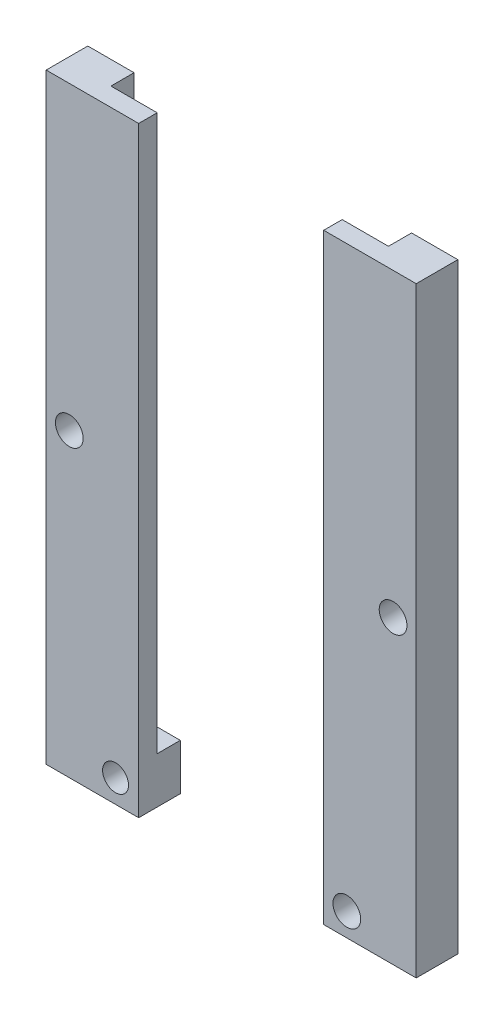
ISO-10303-21;
HEADER;
FILE_DESCRIPTION(('STEP AP214'),'2;1');
FILE_NAME('part.step','',(''),(''),'','','');
FILE_SCHEMA(('AUTOMOTIVE_DESIGN { 1 0 10303 214 1 1 1 1 }'));
ENDSEC;
DATA;
#1=APPLICATION_CONTEXT('core data for automotive mechanical design processes');
#2=APPLICATION_PROTOCOL_DEFINITION('international standard','automotive_design',2000,#1);
#3=PRODUCT_CONTEXT('',#1,'mechanical');
#4=PRODUCT('Part','Part','',(#3));
#5=PRODUCT_RELATED_PRODUCT_CATEGORY('part','',(#4));
#6=PRODUCT_DEFINITION_FORMATION('','',#4);
#7=PRODUCT_DEFINITION_CONTEXT('part definition',#1,'design');
#8=PRODUCT_DEFINITION('design','',#6,#7);
#9=PRODUCT_DEFINITION_SHAPE('','',#8);
#10=(LENGTH_UNIT() NAMED_UNIT(*) SI_UNIT(.MILLI.,.METRE.));
#11=(NAMED_UNIT(*) PLANE_ANGLE_UNIT() SI_UNIT($,.RADIAN.));
#12=(NAMED_UNIT(*) SI_UNIT($,.STERADIAN.) SOLID_ANGLE_UNIT());
#13=UNCERTAINTY_MEASURE_WITH_UNIT(LENGTH_MEASURE(1.E-05),#10,'distance_accuracy_value','');
#14=(GEOMETRIC_REPRESENTATION_CONTEXT(3) GLOBAL_UNCERTAINTY_ASSIGNED_CONTEXT((#13)) GLOBAL_UNIT_ASSIGNED_CONTEXT((#10,
#11,#12)) REPRESENTATION_CONTEXT('',''));
#15=CARTESIAN_POINT('',(0.,0.,0.));
#16=DIRECTION('',(0.,0.,1.));
#17=DIRECTION('',(1.,0.,0.));
#18=AXIS2_PLACEMENT_3D('',#15,#16,#17);
#19=CARTESIAN_POINT('',(-6.42824188498933,-97.8825712637996,4.5));
#20=DIRECTION('',(1.,0.,0.));
#21=DIRECTION('',(0.,0.,-1.));
#22=AXIS2_PLACEMENT_3D('',#19,#20,#21);
#23=PLANE('',#22);
#24=DIRECTION('',(0.,-1.,0.));
#25=VECTOR('',#24,1.);
#26=CARTESIAN_POINT('',(-6.42824188498933,-67.8825712637996,2.5));
#27=LINE('',#26,#25);
#28=CARTESIAN_POINT('',(-6.42824188498933,-37.8825712637996,2.5));
#29=VERTEX_POINT('',#28);
#30=CARTESIAN_POINT('',(-6.42824188498933,-97.8825712637996,2.5));
#31=VERTEX_POINT('',#30);
#32=EDGE_CURVE('E130',#29,#31,#27,.T.);
#33=ORIENTED_EDGE('',*,*,#32,.F.);
#34=DIRECTION('',(0.,0.,1.));
#35=VECTOR('',#34,1.);
#36=CARTESIAN_POINT('',(-6.42824188498933,-37.8825712637996,0.));
#37=LINE('',#36,#35);
#38=CARTESIAN_POINT('',(-6.42824188498933,-37.8825712637996,0.));
#39=VERTEX_POINT('',#38);
#40=EDGE_CURVE('E120',#39,#29,#37,.T.);
#41=ORIENTED_EDGE('',*,*,#40,.F.);
#42=DIRECTION('',(0.,-1.,0.));
#43=VECTOR('',#42,1.);
#44=CARTESIAN_POINT('',(-6.42824188498933,-97.8825712637996,0.));
#45=LINE('',#44,#43);
#46=CARTESIAN_POINT('',(-6.42824188498933,-97.8825712637996,0.));
#47=VERTEX_POINT('',#46);
#48=EDGE_CURVE('E117',#39,#47,#45,.T.);
#49=ORIENTED_EDGE('',*,*,#48,.T.);
#50=DIRECTION('',(0.,0.,-1.));
#51=VECTOR('',#50,1.);
#52=CARTESIAN_POINT('',(-6.42824188498933,-97.8825712637996,4.5));
#53=LINE('',#52,#51);
#54=EDGE_CURVE('E52',#31,#47,#53,.T.);
#55=ORIENTED_EDGE('',*,*,#54,.F.);
#56=EDGE_LOOP('',(#33,#41,#49,#55));
#57=FACE_BOUND('',#56,.T.);
#58=ADVANCED_FACE('F43',(#57),#23,.F.);
#59=CARTESIAN_POINT('',(-11.4282418849893,-97.8825712637996,4.5));
#60=DIRECTION('',(0.,-1.,0.));
#61=DIRECTION('',(0.,0.,-1.));
#62=AXIS2_PLACEMENT_3D('',#59,#60,#61);
#63=PLANE('',#62);
#64=DIRECTION('',(1.,0.,0.));
#65=VECTOR('',#64,1.);
#66=CARTESIAN_POINT('',(-11.4282418849893,-97.8825712637996,2.5));
#67=LINE('',#66,#65);
#68=CARTESIAN_POINT('',(-11.4282418849893,-97.8825712637996,2.5));
#69=VERTEX_POINT('',#68);
#70=EDGE_CURVE('E93',#69,#31,#67,.T.);
#71=ORIENTED_EDGE('',*,*,#70,.T.);
#72=ORIENTED_EDGE('',*,*,#54,.T.);
#73=DIRECTION('',(-1.,0.,0.));
#74=VECTOR('',#73,1.);
#75=CARTESIAN_POINT('',(-11.4282418849893,-97.8825712637996,0.));
#76=LINE('',#75,#74);
#77=CARTESIAN_POINT('',(-11.4282418849893,-97.8825712637996,0.));
#78=VERTEX_POINT('',#77);
#79=EDGE_CURVE('E99',#47,#78,#76,.T.);
#80=ORIENTED_EDGE('',*,*,#79,.T.);
#81=DIRECTION('',(0.,0.,-1.));
#82=VECTOR('',#81,1.);
#83=CARTESIAN_POINT('',(-11.4282418849893,-97.8825712637996,4.5));
#84=LINE('',#83,#82);
#85=EDGE_CURVE('E77',#69,#78,#84,.T.);
#86=ORIENTED_EDGE('',*,*,#85,.F.);
#87=EDGE_LOOP('',(#71,#72,#80,#86));
#88=FACE_BOUND('',#87,.T.);
#89=ADVANCED_FACE('F110',(#88),#63,.F.);
#90=CARTESIAN_POINT('',(-1.42824188498932,-102.8825712638,4.5));
#91=DIRECTION('',(0.,1.,0.));
#92=DIRECTION('',(0.,0.,1.));
#93=AXIS2_PLACEMENT_3D('',#90,#91,#92);
#94=PLANE('',#93);
#95=DIRECTION('',(1.,0.,0.));
#96=VECTOR('',#95,1.);
#97=CARTESIAN_POINT('',(-1.42824188498932,-102.8825712638,0.));
#98=LINE('',#97,#96);
#99=CARTESIAN_POINT('',(-11.4282418849893,-102.8825712638,0.));
#100=VERTEX_POINT('',#99);
#101=CARTESIAN_POINT('',(-1.42824188498932,-102.8825712638,0.));
#102=VERTEX_POINT('',#101);
#103=EDGE_CURVE('E83',#100,#102,#98,.T.);
#104=ORIENTED_EDGE('',*,*,#103,.T.);
#105=DIRECTION('',(0.,0.,-1.));
#106=VECTOR('',#105,1.);
#107=CARTESIAN_POINT('',(-1.42824188498932,-102.8825712638,4.5));
#108=LINE('',#107,#106);
#109=CARTESIAN_POINT('',(-1.42824188498932,-102.8825712638,4.5));
#110=VERTEX_POINT('',#109);
#111=EDGE_CURVE('E12',#110,#102,#108,.T.);
#112=ORIENTED_EDGE('',*,*,#111,.F.);
#113=DIRECTION('',(1.,0.,0.));
#114=VECTOR('',#113,1.);
#115=CARTESIAN_POINT('',(-6.42824188498933,-102.8825712638,4.5));
#116=LINE('',#115,#114);
#117=CARTESIAN_POINT('',(-11.4282418849893,-102.8825712638,4.5));
#118=VERTEX_POINT('',#117);
#119=EDGE_CURVE('E98',#118,#110,#116,.T.);
#120=ORIENTED_EDGE('',*,*,#119,.F.);
#121=DIRECTION('',(0.,0.,-1.));
#122=VECTOR('',#121,1.);
#123=CARTESIAN_POINT('',(-11.4282418849893,-102.8825712638,4.5));
#124=LINE('',#123,#122);
#125=EDGE_CURVE('E96',#118,#100,#124,.T.);
#126=ORIENTED_EDGE('',*,*,#125,.T.);
#127=EDGE_LOOP('',(#104,#112,#120,#126));
#128=FACE_BOUND('',#127,.T.);
#129=ADVANCED_FACE('F45',(#128),#94,.F.);
#130=CARTESIAN_POINT('',(-1.42824188498933,-67.8825712637996,4.5));
#131=DIRECTION('',(-1.,0.,0.));
#132=DIRECTION('',(0.,0.,1.));
#133=AXIS2_PLACEMENT_3D('',#130,#131,#132);
#134=PLANE('',#133);
#135=DIRECTION('',(0.,1.,0.));
#136=VECTOR('',#135,1.);
#137=CARTESIAN_POINT('',(-1.42824188498933,-67.8825712637996,0.));
#138=LINE('',#137,#136);
#139=CARTESIAN_POINT('',(-1.42824188498933,-37.8825712637996,0.));
#140=VERTEX_POINT('',#139);
#141=EDGE_CURVE('E89',#102,#140,#138,.T.);
#142=ORIENTED_EDGE('',*,*,#141,.T.);
#143=DIRECTION('',(0.,0.,-1.));
#144=VECTOR('',#143,1.);
#145=CARTESIAN_POINT('',(-1.42824188498933,-37.8825712637996,4.5));
#146=LINE('',#145,#144);
#147=CARTESIAN_POINT('',(-1.42824188498933,-37.8825712637996,4.5));
#148=VERTEX_POINT('',#147);
#149=EDGE_CURVE('E158',#148,#140,#146,.T.);
#150=ORIENTED_EDGE('',*,*,#149,.F.);
#151=DIRECTION('',(0.,1.,0.));
#152=VECTOR('',#151,1.);
#153=CARTESIAN_POINT('',(-1.42824188498933,-72.8825712637996,4.5));
#154=LINE('',#153,#152);
#155=EDGE_CURVE('E103',#110,#148,#154,.T.);
#156=ORIENTED_EDGE('',*,*,#155,.F.);
#157=ORIENTED_EDGE('',*,*,#111,.T.);
#158=EDGE_LOOP('',(#142,#150,#156,#157));
#159=FACE_BOUND('',#158,.T.);
#160=ADVANCED_FACE('F168',(#159),#134,.F.);
#161=CARTESIAN_POINT('',(-11.4282418849893,-102.8825712638,4.5));
#162=DIRECTION('',(1.,0.,0.));
#163=DIRECTION('',(0.,0.,-1.));
#164=AXIS2_PLACEMENT_3D('',#161,#162,#163);
#165=PLANE('',#164);
#166=DIRECTION('',(0.,-1.,0.));
#167=VECTOR('',#166,1.);
#168=CARTESIAN_POINT('',(-11.4282418849893,-102.8825712638,0.));
#169=LINE('',#168,#167);
#170=EDGE_CURVE('E86',#78,#100,#169,.T.);
#171=ORIENTED_EDGE('',*,*,#170,.T.);
#172=ORIENTED_EDGE('',*,*,#125,.F.);
#173=DIRECTION('',(0.,-1.,0.));
#174=VECTOR('',#173,1.);
#175=CARTESIAN_POINT('',(-11.4282418849893,-102.8825712638,4.5));
#176=LINE('',#175,#174);
#177=CARTESIAN_POINT('',(-11.4282418849893,-37.8825712637996,4.5));
#178=VERTEX_POINT('',#177);
#179=EDGE_CURVE('E60',#178,#118,#176,.T.);
#180=ORIENTED_EDGE('',*,*,#179,.F.);
#181=DIRECTION('',(0.,0.,1.));
#182=VECTOR('',#181,1.);
#183=CARTESIAN_POINT('',(-11.4282418849893,-37.8825712637996,2.5));
#184=LINE('',#183,#182);
#185=CARTESIAN_POINT('',(-11.4282418849893,-37.8825712637996,2.5));
#186=VERTEX_POINT('',#185);
#187=EDGE_CURVE('E149',#186,#178,#184,.T.);
#188=ORIENTED_EDGE('',*,*,#187,.F.);
#189=DIRECTION('',(0.,-1.,0.));
#190=VECTOR('',#189,1.);
#191=CARTESIAN_POINT('',(-11.4282418849893,-67.8825712637996,2.5));
#192=LINE('',#191,#190);
#193=EDGE_CURVE('E129',#186,#69,#192,.T.);
#194=ORIENTED_EDGE('',*,*,#193,.T.);
#195=ORIENTED_EDGE('',*,*,#85,.T.);
#196=EDGE_LOOP('',(#171,#172,#180,#188,#194,#195));
#197=FACE_BOUND('',#196,.T.);
#198=ADVANCED_FACE('F95',(#197),#165,.F.);
#199=CARTESIAN_POINT('',(0.,0.,4.5));
#200=DIRECTION('',(0.,0.,-1.));
#201=DIRECTION('',(-1.,0.,0.));
#202=AXIS2_PLACEMENT_3D('',#199,#200,#201);
#203=PLANE('',#202);
#204=CARTESIAN_POINT('',(-8.92824188498932,-100.3825712638,4.5));
#205=DIRECTION('',(0.,0.,-1.));
#206=DIRECTION('',(-1.,0.,0.));
#207=AXIS2_PLACEMENT_3D('',#204,#205,#206);
#208=CIRCLE('',#207,1.5);
#209=CARTESIAN_POINT('',(-10.4282418849893,-100.3825712638,4.5));
#210=VERTEX_POINT('',#209);
#211=EDGE_CURVE('E133',#210,#210,#208,.T.);
#212=ORIENTED_EDGE('',*,*,#211,.T.);
#213=EDGE_LOOP('',(#212));
#214=FACE_BOUND('',#213,.T.);
#215=CARTESIAN_POINT('',(-3.92824188498932,-70.3825712637996,4.5));
#216=DIRECTION('',(0.,0.,-1.));
#217=DIRECTION('',(-1.,0.,0.));
#218=AXIS2_PLACEMENT_3D('',#215,#216,#217);
#219=CIRCLE('',#218,1.5);
#220=CARTESIAN_POINT('',(-5.42824188498932,-70.3825712637996,4.5));
#221=VERTEX_POINT('',#220);
#222=EDGE_CURVE('E138',#221,#221,#219,.T.);
#223=ORIENTED_EDGE('',*,*,#222,.T.);
#224=EDGE_LOOP('',(#223));
#225=FACE_BOUND('',#224,.T.);
#226=ORIENTED_EDGE('',*,*,#155,.T.);
#227=DIRECTION('',(1.,0.,0.));
#228=VECTOR('',#227,1.);
#229=CARTESIAN_POINT('',(-11.4282418849893,-37.8825712637996,4.5));
#230=LINE('',#229,#228);
#231=EDGE_CURVE('E139',#178,#148,#230,.T.);
#232=ORIENTED_EDGE('',*,*,#231,.F.);
#233=ORIENTED_EDGE('',*,*,#179,.T.);
#234=ORIENTED_EDGE('',*,*,#119,.T.);
#235=EDGE_LOOP('',(#226,#232,#233,#234));
#236=FACE_BOUND('',#235,.T.);
#237=ADVANCED_FACE('F183',(#214,#225,#236),#203,.F.);
#238=CARTESIAN_POINT('',(0.,0.,0.));
#239=DIRECTION('',(0.,0.,-1.));
#240=DIRECTION('',(-1.,0.,0.));
#241=AXIS2_PLACEMENT_3D('',#238,#239,#240);
#242=PLANE('',#241);
#243=CARTESIAN_POINT('',(-8.92824188498932,-100.3825712638,0.));
#244=DIRECTION('',(0.,0.,-1.));
#245=DIRECTION('',(-1.,0.,0.));
#246=AXIS2_PLACEMENT_3D('',#243,#244,#245);
#247=CIRCLE('',#246,1.5);
#248=CARTESIAN_POINT('',(-10.4282418849893,-100.3825712638,0.));
#249=VERTEX_POINT('',#248);
#250=EDGE_CURVE('E142',#249,#249,#247,.T.);
#251=ORIENTED_EDGE('',*,*,#250,.F.);
#252=EDGE_LOOP('',(#251));
#253=FACE_BOUND('',#252,.T.);
#254=CARTESIAN_POINT('',(-3.92824188498932,-70.3825712637996,0.));
#255=DIRECTION('',(0.,0.,-1.));
#256=DIRECTION('',(-1.,0.,0.));
#257=AXIS2_PLACEMENT_3D('',#254,#255,#256);
#258=CIRCLE('',#257,1.5);
#259=CARTESIAN_POINT('',(-5.42824188498932,-70.3825712637996,0.));
#260=VERTEX_POINT('',#259);
#261=EDGE_CURVE('E135',#260,#260,#258,.T.);
#262=ORIENTED_EDGE('',*,*,#261,.F.);
#263=EDGE_LOOP('',(#262));
#264=FACE_BOUND('',#263,.T.);
#265=ORIENTED_EDGE('',*,*,#103,.F.);
#266=ORIENTED_EDGE('',*,*,#170,.F.);
#267=ORIENTED_EDGE('',*,*,#79,.F.);
#268=ORIENTED_EDGE('',*,*,#48,.F.);
#269=DIRECTION('',(-1.,0.,0.));
#270=VECTOR('',#269,1.);
#271=CARTESIAN_POINT('',(-1.42824188498933,-37.8825712637996,0.));
#272=LINE('',#271,#270);
#273=EDGE_CURVE('E156',#140,#39,#272,.T.);
#274=ORIENTED_EDGE('',*,*,#273,.F.);
#275=ORIENTED_EDGE('',*,*,#141,.F.);
#276=EDGE_LOOP('',(#265,#266,#267,#268,#274,#275));
#277=FACE_BOUND('',#276,.T.);
#278=ADVANCED_FACE('F84',(#253,#264,#277),#242,.T.);
#279=CARTESIAN_POINT('',(-11.4282418849893,-67.8825712637996,2.5));
#280=DIRECTION('',(0.,0.,1.));
#281=DIRECTION('',(0.,-1.,0.));
#282=AXIS2_PLACEMENT_3D('',#279,#280,#281);
#283=PLANE('',#282);
#284=ORIENTED_EDGE('',*,*,#32,.T.);
#285=ORIENTED_EDGE('',*,*,#70,.F.);
#286=ORIENTED_EDGE('',*,*,#193,.F.);
#287=DIRECTION('',(-1.,0.,0.));
#288=VECTOR('',#287,1.);
#289=CARTESIAN_POINT('',(-6.42824188498933,-37.8825712637996,2.5));
#290=LINE('',#289,#288);
#291=EDGE_CURVE('E152',#29,#186,#290,.T.);
#292=ORIENTED_EDGE('',*,*,#291,.F.);
#293=EDGE_LOOP('',(#284,#285,#286,#292));
#294=FACE_BOUND('',#293,.T.);
#295=ADVANCED_FACE('F179',(#294),#283,.F.);
#296=CARTESIAN_POINT('',(-3.92824188498932,-70.3825712637996,4.5));
#297=DIRECTION('',(0.,0.,-1.));
#298=DIRECTION('',(-1.,0.,0.));
#299=AXIS2_PLACEMENT_3D('',#296,#297,#298);
#300=CYLINDRICAL_SURFACE('',#299,1.5);
#301=ORIENTED_EDGE('',*,*,#222,.F.);
#302=EDGE_LOOP('',(#301));
#303=FACE_BOUND('',#302,.T.);
#304=ORIENTED_EDGE('',*,*,#261,.T.);
#305=EDGE_LOOP('',(#304));
#306=FACE_BOUND('',#305,.T.);
#307=ADVANCED_FACE('F214',(#303,#306),#300,.F.);
#308=CARTESIAN_POINT('',(-8.92824188498932,-100.3825712638,4.5));
#309=DIRECTION('',(0.,0.,-1.));
#310=DIRECTION('',(-1.,0.,0.));
#311=AXIS2_PLACEMENT_3D('',#308,#309,#310);
#312=CYLINDRICAL_SURFACE('',#311,1.5);
#313=ORIENTED_EDGE('',*,*,#211,.F.);
#314=EDGE_LOOP('',(#313));
#315=FACE_BOUND('',#314,.T.);
#316=ORIENTED_EDGE('',*,*,#250,.T.);
#317=EDGE_LOOP('',(#316));
#318=FACE_BOUND('',#317,.T.);
#319=ADVANCED_FACE('F217',(#315,#318),#312,.F.);
#320=CARTESIAN_POINT('',(0.,-37.8825712637996,0.));
#321=DIRECTION('',(0.,1.,0.));
#322=DIRECTION('',(0.,0.,1.));
#323=AXIS2_PLACEMENT_3D('',#320,#321,#322);
#324=PLANE('',#323);
#325=ORIENTED_EDGE('',*,*,#149,.T.);
#326=ORIENTED_EDGE('',*,*,#273,.T.);
#327=ORIENTED_EDGE('',*,*,#40,.T.);
#328=ORIENTED_EDGE('',*,*,#291,.T.);
#329=ORIENTED_EDGE('',*,*,#187,.T.);
#330=ORIENTED_EDGE('',*,*,#231,.T.);
#331=EDGE_LOOP('',(#325,#326,#327,#328,#329,#330));
#332=FACE_BOUND('',#331,.T.);
#333=ADVANCED_FACE('F163',(#332),#324,.T.);
#334=CLOSED_SHELL('',(#58,#89,#129,#160,#198,#237,#278,#295,#307,#319,#333));
#335=MANIFOLD_SOLID_BREP('B2',#334);
#336=CARTESIAN_POINT('',(-36.4282418849893,-97.8825712637996,4.5));
#337=DIRECTION('',(0.,-1.,0.));
#338=DIRECTION('',(0.,0.,-1.));
#339=AXIS2_PLACEMENT_3D('',#336,#337,#338);
#340=PLANE('',#339);
#341=DIRECTION('',(-1.,0.,0.));
#342=VECTOR('',#341,1.);
#343=CARTESIAN_POINT('',(-31.4282418849893,-97.8825712637996,2.5));
#344=LINE('',#343,#342);
#345=CARTESIAN_POINT('',(-31.4282418849893,-97.8825712637996,2.5));
#346=VERTEX_POINT('',#345);
#347=CARTESIAN_POINT('',(-36.4282418849893,-97.8825712637996,2.5));
#348=VERTEX_POINT('',#347);
#349=EDGE_CURVE('E397',#346,#348,#344,.T.);
#350=ORIENTED_EDGE('',*,*,#349,.F.);
#351=DIRECTION('',(0.,0.,-1.));
#352=VECTOR('',#351,1.);
#353=CARTESIAN_POINT('',(-31.4282418849893,-97.8825712637996,4.5));
#354=LINE('',#353,#352);
#355=CARTESIAN_POINT('',(-31.4282418849893,-97.8825712637996,0.));
#356=VERTEX_POINT('',#355);
#357=EDGE_CURVE('E329',#346,#356,#354,.T.);
#358=ORIENTED_EDGE('',*,*,#357,.T.);
#359=DIRECTION('',(-1.,0.,0.));
#360=VECTOR('',#359,1.);
#361=CARTESIAN_POINT('',(-36.4282418849893,-97.8825712637996,0.));
#362=LINE('',#361,#360);
#363=CARTESIAN_POINT('',(-36.4282418849893,-97.8825712637996,0.));
#364=VERTEX_POINT('',#363);
#365=EDGE_CURVE('E395',#356,#364,#362,.T.);
#366=ORIENTED_EDGE('',*,*,#365,.T.);
#367=DIRECTION('',(0.,0.,-1.));
#368=VECTOR('',#367,1.);
#369=CARTESIAN_POINT('',(-36.4282418849893,-97.8825712637996,4.5));
#370=LINE('',#369,#368);
#371=EDGE_CURVE('E355',#348,#364,#370,.T.);
#372=ORIENTED_EDGE('',*,*,#371,.F.);
#373=EDGE_LOOP('',(#350,#358,#366,#372));
#374=FACE_BOUND('',#373,.T.);
#375=ADVANCED_FACE('F320',(#374),#340,.F.);
#376=CARTESIAN_POINT('',(-36.4282418849893,-72.8825712637996,4.5));
#377=DIRECTION('',(-1.,0.,0.));
#378=DIRECTION('',(0.,0.,1.));
#379=AXIS2_PLACEMENT_3D('',#376,#377,#378);
#380=PLANE('',#379);
#381=DIRECTION('',(0.,1.,0.));
#382=VECTOR('',#381,1.);
#383=CARTESIAN_POINT('',(-36.4282418849893,-67.8825712637996,2.5));
#384=LINE('',#383,#382);
#385=CARTESIAN_POINT('',(-36.4282418849893,-37.8825712637996,2.5));
#386=VERTEX_POINT('',#385);
#387=EDGE_CURVE('E408',#348,#386,#384,.T.);
#388=ORIENTED_EDGE('',*,*,#387,.F.);
#389=ORIENTED_EDGE('',*,*,#371,.T.);
#390=DIRECTION('',(0.,1.,0.));
#391=VECTOR('',#390,1.);
#392=CARTESIAN_POINT('',(-36.4282418849893,-72.8825712637996,0.));
#393=LINE('',#392,#391);
#394=CARTESIAN_POINT('',(-36.4282418849893,-37.8825712637996,0.));
#395=VERTEX_POINT('',#394);
#396=EDGE_CURVE('E374',#364,#395,#393,.T.);
#397=ORIENTED_EDGE('',*,*,#396,.T.);
#398=DIRECTION('',(0.,0.,-1.));
#399=VECTOR('',#398,1.);
#400=CARTESIAN_POINT('',(-36.4282418849893,-37.8825712637996,2.5));
#401=LINE('',#400,#399);
#402=EDGE_CURVE('E436',#386,#395,#401,.T.);
#403=ORIENTED_EDGE('',*,*,#402,.F.);
#404=EDGE_LOOP('',(#388,#389,#397,#403));
#405=FACE_BOUND('',#404,.T.);
#406=ADVANCED_FACE('F445',(#405),#380,.F.);
#407=CARTESIAN_POINT('',(-31.4282418849893,-97.8825712637996,4.5));
#408=DIRECTION('',(-1.,0.,0.));
#409=DIRECTION('',(0.,0.,1.));
#410=AXIS2_PLACEMENT_3D('',#407,#408,#409);
#411=PLANE('',#410);
#412=DIRECTION('',(0.,1.,0.));
#413=VECTOR('',#412,1.);
#414=CARTESIAN_POINT('',(-31.4282418849893,-97.8825712637996,0.));
#415=LINE('',#414,#413);
#416=CARTESIAN_POINT('',(-31.4282418849893,-102.8825712638,0.));
#417=VERTEX_POINT('',#416);
#418=EDGE_CURVE('E385',#417,#356,#415,.T.);
#419=ORIENTED_EDGE('',*,*,#418,.T.);
#420=ORIENTED_EDGE('',*,*,#357,.F.);
#421=DIRECTION('',(0.,1.,0.));
#422=VECTOR('',#421,1.);
#423=CARTESIAN_POINT('',(-31.4282418849893,-67.8825712637996,2.5));
#424=LINE('',#423,#422);
#425=CARTESIAN_POINT('',(-31.4282418849893,-37.8825712637996,2.5));
#426=VERTEX_POINT('',#425);
#427=EDGE_CURVE('E407',#346,#426,#424,.T.);
#428=ORIENTED_EDGE('',*,*,#427,.T.);
#429=DIRECTION('',(0.,0.,-1.));
#430=VECTOR('',#429,1.);
#431=CARTESIAN_POINT('',(-31.4282418849893,-37.8825712637996,4.5));
#432=LINE('',#431,#430);
#433=CARTESIAN_POINT('',(-31.4282418849893,-37.8825712637996,4.5));
#434=VERTEX_POINT('',#433);
#435=EDGE_CURVE('E427',#434,#426,#432,.T.);
#436=ORIENTED_EDGE('',*,*,#435,.F.);
#437=DIRECTION('',(0.,1.,0.));
#438=VECTOR('',#437,1.);
#439=CARTESIAN_POINT('',(-31.4282418849893,-97.8825712637996,4.5));
#440=LINE('',#439,#438);
#441=CARTESIAN_POINT('',(-31.4282418849893,-102.8825712638,4.5));
#442=VERTEX_POINT('',#441);
#443=EDGE_CURVE('E387',#442,#434,#440,.T.);
#444=ORIENTED_EDGE('',*,*,#443,.F.);
#445=DIRECTION('',(0.,0.,-1.));
#446=VECTOR('',#445,1.);
#447=CARTESIAN_POINT('',(-31.4282418849893,-102.8825712638,4.5));
#448=LINE('',#447,#446);
#449=EDGE_CURVE('E41',#442,#417,#448,.T.);
#450=ORIENTED_EDGE('',*,*,#449,.T.);
#451=EDGE_LOOP('',(#419,#420,#428,#436,#444,#450));
#452=FACE_BOUND('',#451,.T.);
#453=ADVANCED_FACE('F322',(#452),#411,.F.);
#454=CARTESIAN_POINT('',(-41.4282418849893,-72.8825712637996,4.5));
#455=DIRECTION('',(1.,0.,0.));
#456=DIRECTION('',(0.,1.,0.));
#457=AXIS2_PLACEMENT_3D('',#454,#455,#456);
#458=PLANE('',#457);
#459=DIRECTION('',(0.,-1.,0.));
#460=VECTOR('',#459,1.);
#461=CARTESIAN_POINT('',(-41.4282418849893,-72.8825712637996,0.));
#462=LINE('',#461,#460);
#463=CARTESIAN_POINT('',(-41.4282418849893,-37.8825712637996,0.));
#464=VERTEX_POINT('',#463);
#465=CARTESIAN_POINT('',(-41.4282418849893,-102.8825712638,0.));
#466=VERTEX_POINT('',#465);
#467=EDGE_CURVE('E362',#464,#466,#462,.T.);
#468=ORIENTED_EDGE('',*,*,#467,.T.);
#469=DIRECTION('',(0.,0.,-1.));
#470=VECTOR('',#469,1.);
#471=CARTESIAN_POINT('',(-41.4282418849893,-102.8825712638,4.5));
#472=LINE('',#471,#470);
#473=CARTESIAN_POINT('',(-41.4282418849893,-102.8825712638,4.5));
#474=VERTEX_POINT('',#473);
#475=EDGE_CURVE('E365',#474,#466,#472,.T.);
#476=ORIENTED_EDGE('',*,*,#475,.F.);
#477=DIRECTION('',(0.,-1.,0.));
#478=VECTOR('',#477,1.);
#479=CARTESIAN_POINT('',(-41.4282418849893,-67.8825712637996,4.5));
#480=LINE('',#479,#478);
#481=CARTESIAN_POINT('',(-41.4282418849893,-37.8825712637996,4.5));
#482=VERTEX_POINT('',#481);
#483=EDGE_CURVE('E337',#482,#474,#480,.T.);
#484=ORIENTED_EDGE('',*,*,#483,.F.);
#485=DIRECTION('',(0.,0.,1.));
#486=VECTOR('',#485,1.);
#487=CARTESIAN_POINT('',(-41.4282418849893,-37.8825712637996,0.));
#488=LINE('',#487,#486);
#489=EDGE_CURVE('E368',#464,#482,#488,.T.);
#490=ORIENTED_EDGE('',*,*,#489,.F.);
#491=EDGE_LOOP('',(#468,#476,#484,#490));
#492=FACE_BOUND('',#491,.T.);
#493=ADVANCED_FACE('F364',(#492),#458,.F.);
#494=CARTESIAN_POINT('',(-41.4282418849893,-102.8825712638,4.5));
#495=DIRECTION('',(0.,1.,0.));
#496=DIRECTION('',(0.,0.,1.));
#497=AXIS2_PLACEMENT_3D('',#494,#495,#496);
#498=PLANE('',#497);
#499=DIRECTION('',(1.,0.,0.));
#500=VECTOR('',#499,1.);
#501=CARTESIAN_POINT('',(-41.4282418849893,-102.8825712638,0.));
#502=LINE('',#501,#500);
#503=EDGE_CURVE('E373',#466,#417,#502,.T.);
#504=ORIENTED_EDGE('',*,*,#503,.T.);
#505=ORIENTED_EDGE('',*,*,#449,.F.);
#506=DIRECTION('',(1.,0.,0.));
#507=VECTOR('',#506,1.);
#508=CARTESIAN_POINT('',(-31.4282418849893,-102.8825712638,4.5));
#509=LINE('',#508,#507);
#510=EDGE_CURVE('E380',#474,#442,#509,.T.);
#511=ORIENTED_EDGE('',*,*,#510,.F.);
#512=ORIENTED_EDGE('',*,*,#475,.T.);
#513=EDGE_LOOP('',(#504,#505,#511,#512));
#514=FACE_BOUND('',#513,.T.);
#515=ADVANCED_FACE('F377',(#514),#498,.F.);
#516=CARTESIAN_POINT('',(0.,0.,4.5));
#517=DIRECTION('',(0.,0.,1.));
#518=DIRECTION('',(1.,0.,0.));
#519=AXIS2_PLACEMENT_3D('',#516,#517,#518);
#520=PLANE('',#519);
#521=CARTESIAN_POINT('',(-33.9282418849893,-100.3825712638,4.5));
#522=DIRECTION('',(0.,0.,-1.));
#523=DIRECTION('',(-1.,0.,0.));
#524=AXIS2_PLACEMENT_3D('',#521,#522,#523);
#525=CIRCLE('',#524,1.4016587185009);
#526=CARTESIAN_POINT('',(-35.3299006034902,-100.3825712638,4.5));
#527=VERTEX_POINT('',#526);
#528=EDGE_CURVE('E411',#527,#527,#525,.T.);
#529=ORIENTED_EDGE('',*,*,#528,.T.);
#530=EDGE_LOOP('',(#529));
#531=FACE_BOUND('',#530,.T.);
#532=CARTESIAN_POINT('',(-38.9282418849893,-70.3825712637996,4.5));
#533=DIRECTION('',(0.,0.,-1.));
#534=DIRECTION('',(-1.,0.,0.));
#535=AXIS2_PLACEMENT_3D('',#532,#533,#534);
#536=CIRCLE('',#535,1.5);
#537=CARTESIAN_POINT('',(-40.4282418849893,-70.3825712637996,4.5));
#538=VERTEX_POINT('',#537);
#539=EDGE_CURVE('E416',#538,#538,#536,.T.);
#540=ORIENTED_EDGE('',*,*,#539,.T.);
#541=EDGE_LOOP('',(#540));
#542=FACE_BOUND('',#541,.T.);
#543=ORIENTED_EDGE('',*,*,#510,.T.);
#544=ORIENTED_EDGE('',*,*,#443,.T.);
#545=DIRECTION('',(1.,0.,0.));
#546=VECTOR('',#545,1.);
#547=CARTESIAN_POINT('',(-41.4282418849893,-37.8825712637996,4.5));
#548=LINE('',#547,#546);
#549=EDGE_CURVE('E430',#482,#434,#548,.T.);
#550=ORIENTED_EDGE('',*,*,#549,.F.);
#551=ORIENTED_EDGE('',*,*,#483,.T.);
#552=EDGE_LOOP('',(#543,#544,#550,#551));
#553=FACE_BOUND('',#552,.T.);
#554=ADVANCED_FACE('F458',(#531,#542,#553),#520,.T.);
#555=CARTESIAN_POINT('',(0.,0.,0.));
#556=DIRECTION('',(0.,0.,1.));
#557=DIRECTION('',(1.,0.,0.));
#558=AXIS2_PLACEMENT_3D('',#555,#556,#557);
#559=PLANE('',#558);
#560=CARTESIAN_POINT('',(-33.9282418849893,-100.3825712638,0.));
#561=DIRECTION('',(0.,0.,-1.));
#562=DIRECTION('',(-1.,0.,0.));
#563=AXIS2_PLACEMENT_3D('',#560,#561,#562);
#564=CIRCLE('',#563,1.4016587185009);
#565=CARTESIAN_POINT('',(-35.3299006034902,-100.3825712638,0.));
#566=VERTEX_POINT('',#565);
#567=EDGE_CURVE('E420',#566,#566,#564,.T.);
#568=ORIENTED_EDGE('',*,*,#567,.F.);
#569=EDGE_LOOP('',(#568));
#570=FACE_BOUND('',#569,.T.);
#571=CARTESIAN_POINT('',(-38.9282418849893,-70.3825712637996,0.));
#572=DIRECTION('',(0.,0.,-1.));
#573=DIRECTION('',(-1.,0.,0.));
#574=AXIS2_PLACEMENT_3D('',#571,#572,#573);
#575=CIRCLE('',#574,1.5);
#576=CARTESIAN_POINT('',(-40.4282418849893,-70.3825712637996,0.));
#577=VERTEX_POINT('',#576);
#578=EDGE_CURVE('E413',#577,#577,#575,.T.);
#579=ORIENTED_EDGE('',*,*,#578,.F.);
#580=EDGE_LOOP('',(#579));
#581=FACE_BOUND('',#580,.T.);
#582=ORIENTED_EDGE('',*,*,#418,.F.);
#583=ORIENTED_EDGE('',*,*,#503,.F.);
#584=ORIENTED_EDGE('',*,*,#467,.F.);
#585=DIRECTION('',(-1.,0.,0.));
#586=VECTOR('',#585,1.);
#587=CARTESIAN_POINT('',(-36.4282418849893,-37.8825712637996,0.));
#588=LINE('',#587,#586);
#589=EDGE_CURVE('E434',#395,#464,#588,.T.);
#590=ORIENTED_EDGE('',*,*,#589,.F.);
#591=ORIENTED_EDGE('',*,*,#396,.F.);
#592=ORIENTED_EDGE('',*,*,#365,.F.);
#593=EDGE_LOOP('',(#582,#583,#584,#590,#591,#592));
#594=FACE_BOUND('',#593,.T.);
#595=ADVANCED_FACE('F382',(#570,#581,#594),#559,.F.);
#596=CARTESIAN_POINT('',(-31.4282418849893,-67.8825712637996,2.5));
#597=DIRECTION('',(0.,0.,1.));
#598=DIRECTION('',(0.,-1.,0.));
#599=AXIS2_PLACEMENT_3D('',#596,#597,#598);
#600=PLANE('',#599);
#601=ORIENTED_EDGE('',*,*,#387,.T.);
#602=DIRECTION('',(-1.,0.,0.));
#603=VECTOR('',#602,1.);
#604=CARTESIAN_POINT('',(-31.4282418849893,-37.8825712637996,2.5));
#605=LINE('',#604,#603);
#606=EDGE_CURVE('E417',#426,#386,#605,.T.);
#607=ORIENTED_EDGE('',*,*,#606,.F.);
#608=ORIENTED_EDGE('',*,*,#427,.F.);
#609=ORIENTED_EDGE('',*,*,#349,.T.);
#610=EDGE_LOOP('',(#601,#607,#608,#609));
#611=FACE_BOUND('',#610,.T.);
#612=ADVANCED_FACE('F455',(#611),#600,.F.);
#613=CARTESIAN_POINT('',(-38.9282418849893,-70.3825712637996,4.5));
#614=DIRECTION('',(0.,0.,-1.));
#615=DIRECTION('',(-1.,0.,0.));
#616=AXIS2_PLACEMENT_3D('',#613,#614,#615);
#617=CYLINDRICAL_SURFACE('',#616,1.5);
#618=ORIENTED_EDGE('',*,*,#539,.F.);
#619=EDGE_LOOP('',(#618));
#620=FACE_BOUND('',#619,.T.);
#621=ORIENTED_EDGE('',*,*,#578,.T.);
#622=EDGE_LOOP('',(#621));
#623=FACE_BOUND('',#622,.T.);
#624=ADVANCED_FACE('F496',(#620,#623),#617,.F.);
#625=CARTESIAN_POINT('',(-33.9282418849893,-100.3825712638,4.5));
#626=DIRECTION('',(0.,0.,-1.));
#627=DIRECTION('',(-1.,0.,0.));
#628=AXIS2_PLACEMENT_3D('',#625,#626,#627);
#629=CYLINDRICAL_SURFACE('',#628,1.4016587185009);
#630=ORIENTED_EDGE('',*,*,#528,.F.);
#631=EDGE_LOOP('',(#630));
#632=FACE_BOUND('',#631,.T.);
#633=ORIENTED_EDGE('',*,*,#567,.T.);
#634=EDGE_LOOP('',(#633));
#635=FACE_BOUND('',#634,.T.);
#636=ADVANCED_FACE('F493',(#632,#635),#629,.F.);
#637=CARTESIAN_POINT('',(0.,-37.8825712637996,0.));
#638=DIRECTION('',(0.,1.,0.));
#639=DIRECTION('',(0.,0.,1.));
#640=AXIS2_PLACEMENT_3D('',#637,#638,#639);
#641=PLANE('',#640);
#642=ORIENTED_EDGE('',*,*,#402,.T.);
#643=ORIENTED_EDGE('',*,*,#589,.T.);
#644=ORIENTED_EDGE('',*,*,#489,.T.);
#645=ORIENTED_EDGE('',*,*,#549,.T.);
#646=ORIENTED_EDGE('',*,*,#435,.T.);
#647=ORIENTED_EDGE('',*,*,#606,.T.);
#648=EDGE_LOOP('',(#642,#643,#644,#645,#646,#647));
#649=FACE_BOUND('',#648,.T.);
#650=ADVANCED_FACE('F441',(#649),#641,.T.);
#651=CLOSED_SHELL('',(#375,#406,#453,#493,#515,#554,#595,#612,#624,#636,#650));
#652=MANIFOLD_SOLID_BREP('B6',#651);
#653=ADVANCED_BREP_SHAPE_REPRESENTATION('',(#18,#335,#652),#14);
#654=SHAPE_DEFINITION_REPRESENTATION(#9,#653);
ENDSEC;
END-ISO-10303-21;
